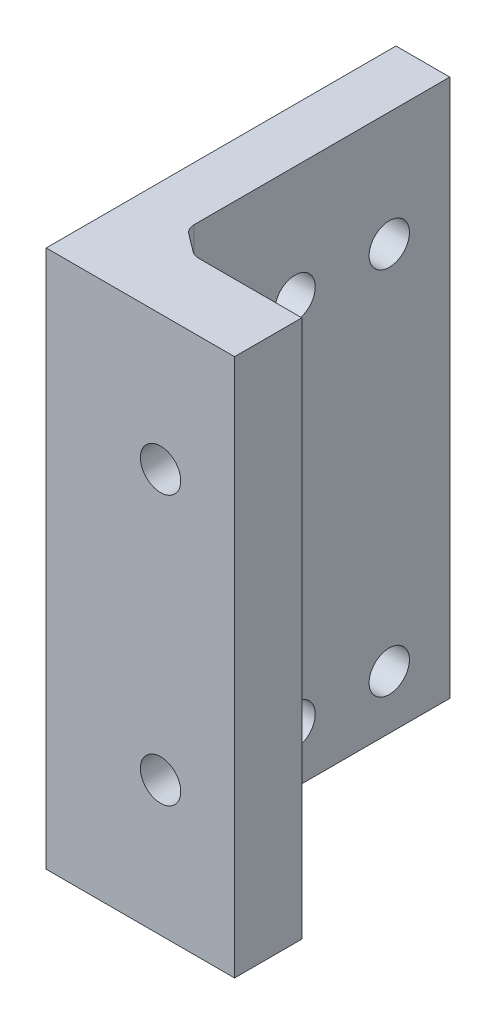
ISO-10303-21;
HEADER;
FILE_DESCRIPTION(('STEP AP214'),'2;1');
FILE_NAME('part.step','',(''),(''),'','','');
FILE_SCHEMA(('AUTOMOTIVE_DESIGN { 1 0 10303 214 1 1 1 1 }'));
ENDSEC;
DATA;
#1=APPLICATION_CONTEXT('core data for automotive mechanical design processes');
#2=APPLICATION_PROTOCOL_DEFINITION('international standard','automotive_design',2000,#1);
#3=PRODUCT_CONTEXT('',#1,'mechanical');
#4=PRODUCT('Part','Part','',(#3));
#5=PRODUCT_RELATED_PRODUCT_CATEGORY('part','',(#4));
#6=PRODUCT_DEFINITION_FORMATION('','',#4);
#7=PRODUCT_DEFINITION_CONTEXT('part definition',#1,'design');
#8=PRODUCT_DEFINITION('design','',#6,#7);
#9=PRODUCT_DEFINITION_SHAPE('','',#8);
#10=(LENGTH_UNIT() NAMED_UNIT(*) SI_UNIT(.MILLI.,.METRE.));
#11=(NAMED_UNIT(*) PLANE_ANGLE_UNIT() SI_UNIT($,.RADIAN.));
#12=(NAMED_UNIT(*) SI_UNIT($,.STERADIAN.) SOLID_ANGLE_UNIT());
#13=UNCERTAINTY_MEASURE_WITH_UNIT(LENGTH_MEASURE(1.E-05),#10,'distance_accuracy_value','');
#14=(GEOMETRIC_REPRESENTATION_CONTEXT(3) GLOBAL_UNCERTAINTY_ASSIGNED_CONTEXT((#13)) GLOBAL_UNIT_ASSIGNED_CONTEXT((#10,
#11,#12)) REPRESENTATION_CONTEXT('',''));
#15=CARTESIAN_POINT('',(0.,0.,0.));
#16=DIRECTION('',(0.,0.,1.));
#17=DIRECTION('',(1.,0.,0.));
#18=AXIS2_PLACEMENT_3D('',#15,#16,#17);
#19=CARTESIAN_POINT('',(15.,-20.,-4.));
#20=DIRECTION('',(1.,0.,0.));
#21=DIRECTION('',(0.,0.,-1.));
#22=AXIS2_PLACEMENT_3D('',#19,#20,#21);
#23=PLANE('',#22);
#24=DIRECTION('',(0.,0.,1.));
#25=VECTOR('',#24,1.);
#26=CARTESIAN_POINT('',(15.,20.,-4.));
#27=LINE('',#26,#25);
#28=CARTESIAN_POINT('',(15.,20.,-4.));
#29=VERTEX_POINT('',#28);
#30=CARTESIAN_POINT('',(15.,20.,15.));
#31=VERTEX_POINT('',#30);
#32=EDGE_CURVE('E189',#29,#31,#27,.T.);
#33=ORIENTED_EDGE('',*,*,#32,.T.);
#34=DIRECTION('',(0.,-1.,0.));
#35=VECTOR('',#34,1.);
#36=CARTESIAN_POINT('',(15.,-20.,15.));
#37=LINE('',#36,#35);
#38=CARTESIAN_POINT('',(15.,-20.,15.));
#39=VERTEX_POINT('',#38);
#40=EDGE_CURVE('E190',#31,#39,#37,.T.);
#41=ORIENTED_EDGE('',*,*,#40,.T.);
#42=DIRECTION('',(0.,0.,1.));
#43=VECTOR('',#42,1.);
#44=CARTESIAN_POINT('',(15.,-20.,-4.));
#45=LINE('',#44,#43);
#46=CARTESIAN_POINT('',(15.,-20.,-4.));
#47=VERTEX_POINT('',#46);
#48=EDGE_CURVE('E114',#47,#39,#45,.T.);
#49=ORIENTED_EDGE('',*,*,#48,.F.);
#50=DIRECTION('',(0.,1.,0.));
#51=VECTOR('',#50,1.);
#52=CARTESIAN_POINT('',(15.,-20.,-4.));
#53=LINE('',#52,#51);
#54=EDGE_CURVE('E178',#47,#29,#53,.T.);
#55=ORIENTED_EDGE('',*,*,#54,.T.);
#56=EDGE_LOOP('',(#33,#41,#49,#55));
#57=FACE_BOUND('',#56,.T.);
#58=CARTESIAN_POINT('',(15.,11.499999999999,7.5));
#59=DIRECTION('',(1.,0.,0.));
#60=DIRECTION('',(0.,0.,-1.));
#61=AXIS2_PLACEMENT_3D('',#58,#59,#60);
#62=CIRCLE('',#61,1.5);
#63=CARTESIAN_POINT('',(15.,11.499999999999,6.));
#64=VERTEX_POINT('',#63);
#65=EDGE_CURVE('E156',#64,#64,#62,.T.);
#66=ORIENTED_EDGE('',*,*,#65,.F.);
#67=EDGE_LOOP('',(#66));
#68=FACE_BOUND('',#67,.T.);
#69=CARTESIAN_POINT('',(15.,-16.000000000001,7.5));
#70=DIRECTION('',(1.,0.,0.));
#71=DIRECTION('',(0.,0.,-1.));
#72=AXIS2_PLACEMENT_3D('',#69,#70,#71);
#73=CIRCLE('',#72,1.5);
#74=CARTESIAN_POINT('',(15.,-16.000000000001,6.));
#75=VERTEX_POINT('',#74);
#76=EDGE_CURVE('E167',#75,#75,#73,.T.);
#77=ORIENTED_EDGE('',*,*,#76,.F.);
#78=EDGE_LOOP('',(#77));
#79=FACE_BOUND('',#78,.T.);
#80=CARTESIAN_POINT('',(15.,-16.000000000001,0.499999999999231));
#81=DIRECTION('',(1.,0.,0.));
#82=DIRECTION('',(0.,0.,-1.));
#83=AXIS2_PLACEMENT_3D('',#80,#81,#82);
#84=CIRCLE('',#83,1.5);
#85=CARTESIAN_POINT('',(15.,-16.000000000001,-1.00000000000077));
#86=VERTEX_POINT('',#85);
#87=EDGE_CURVE('E161',#86,#86,#84,.T.);
#88=ORIENTED_EDGE('',*,*,#87,.F.);
#89=EDGE_LOOP('',(#88));
#90=FACE_BOUND('',#89,.T.);
#91=CARTESIAN_POINT('',(15.,11.499999999999,0.499999999999007));
#92=DIRECTION('',(1.,0.,0.));
#93=DIRECTION('',(0.,0.,-1.));
#94=AXIS2_PLACEMENT_3D('',#91,#92,#93);
#95=CIRCLE('',#94,1.5);
#96=CARTESIAN_POINT('',(15.,11.499999999999,-1.00000000000099));
#97=VERTEX_POINT('',#96);
#98=EDGE_CURVE('E160',#97,#97,#95,.T.);
#99=ORIENTED_EDGE('',*,*,#98,.F.);
#100=EDGE_LOOP('',(#99));
#101=FACE_BOUND('',#100,.T.);
#102=ADVANCED_FACE('F34',(#57,#68,#79,#90,#101),#23,.T.);
#103=CARTESIAN_POINT('',(15.,-20.,-4.));
#104=DIRECTION('',(0.,-1.,0.));
#105=DIRECTION('',(1.,0.,0.));
#106=AXIS2_PLACEMENT_3D('',#103,#104,#105);
#107=PLANE('',#106);
#108=ORIENTED_EDGE('',*,*,#48,.T.);
#109=CARTESIAN_POINT('',(16.,-20.,15.));
#110=DIRECTION('',(0.,-1.,0.));
#111=DIRECTION('',(1.,0.,0.));
#112=AXIS2_PLACEMENT_3D('',#109,#110,#111);
#113=CIRCLE('',#112,1.);
#114=CARTESIAN_POINT('',(15.4,-20.,15.8));
#115=VERTEX_POINT('',#114);
#116=EDGE_CURVE('E203',#39,#115,#113,.F.);
#117=ORIENTED_EDGE('',*,*,#116,.T.);
#118=DIRECTION('',(0.799999999999999,0.,0.600000000000001));
#119=VECTOR('',#118,1.);
#120=CARTESIAN_POINT('',(15.,-20.,15.5));
#121=LINE('',#120,#119);
#122=CARTESIAN_POINT('',(16.7333333333334,-20.,16.8));
#123=VERTEX_POINT('',#122);
#124=EDGE_CURVE('E221',#115,#123,#121,.T.);
#125=ORIENTED_EDGE('',*,*,#124,.T.);
#126=CARTESIAN_POINT('',(17.3333333333334,-20.,16.));
#127=DIRECTION('',(0.,-1.,0.));
#128=DIRECTION('',(1.,0.,0.));
#129=AXIS2_PLACEMENT_3D('',#126,#127,#128);
#130=CIRCLE('',#129,1.);
#131=CARTESIAN_POINT('',(17.3333333333334,-20.,17.));
#132=VERTEX_POINT('',#131);
#133=EDGE_CURVE('E42',#123,#132,#130,.F.);
#134=ORIENTED_EDGE('',*,*,#133,.T.);
#135=DIRECTION('',(-1.,0.,0.));
#136=VECTOR('',#135,1.);
#137=CARTESIAN_POINT('',(25.,-20.,17.));
#138=LINE('',#137,#136);
#139=CARTESIAN_POINT('',(25.,-20.,17.));
#140=VERTEX_POINT('',#139);
#141=EDGE_CURVE('E154',#140,#132,#138,.T.);
#142=ORIENTED_EDGE('',*,*,#141,.F.);
#143=DIRECTION('',(0.,0.,-1.));
#144=VECTOR('',#143,1.);
#145=CARTESIAN_POINT('',(25.,-20.,20.));
#146=LINE('',#145,#144);
#147=CARTESIAN_POINT('',(25.,-20.,22.));
#148=VERTEX_POINT('',#147);
#149=EDGE_CURVE('E121',#148,#140,#146,.T.);
#150=ORIENTED_EDGE('',*,*,#149,.F.);
#151=DIRECTION('',(1.,0.,0.));
#152=VECTOR('',#151,1.);
#153=CARTESIAN_POINT('',(11.,-20.,22.));
#154=LINE('',#153,#152);
#155=CARTESIAN_POINT('',(11.,-20.,22.));
#156=VERTEX_POINT('',#155);
#157=EDGE_CURVE('E118',#156,#148,#154,.T.);
#158=ORIENTED_EDGE('',*,*,#157,.F.);
#159=DIRECTION('',(0.,0.,1.));
#160=VECTOR('',#159,1.);
#161=CARTESIAN_POINT('',(11.,-20.,-4.));
#162=LINE('',#161,#160);
#163=CARTESIAN_POINT('',(11.,-20.,-4.));
#164=VERTEX_POINT('',#163);
#165=EDGE_CURVE('E105',#164,#156,#162,.T.);
#166=ORIENTED_EDGE('',*,*,#165,.F.);
#167=DIRECTION('',(1.,0.,0.));
#168=VECTOR('',#167,1.);
#169=CARTESIAN_POINT('',(15.,-20.,-4.));
#170=LINE('',#169,#168);
#171=EDGE_CURVE('E187',#164,#47,#170,.T.);
#172=ORIENTED_EDGE('',*,*,#171,.T.);
#173=EDGE_LOOP('',(#108,#117,#125,#134,#142,#150,#158,#166,#172));
#174=FACE_BOUND('',#173,.T.);
#175=ADVANCED_FACE('F120',(#174),#107,.T.);
#176=CARTESIAN_POINT('',(11.,-20.,-4.));
#177=DIRECTION('',(-1.,0.,0.));
#178=DIRECTION('',(0.,-1.,0.));
#179=AXIS2_PLACEMENT_3D('',#176,#177,#178);
#180=PLANE('',#179);
#181=CARTESIAN_POINT('',(11.,11.499999999999,7.5));
#182=DIRECTION('',(1.,0.,0.));
#183=DIRECTION('',(0.,0.,-1.));
#184=AXIS2_PLACEMENT_3D('',#181,#182,#183);
#185=CIRCLE('',#184,1.5);
#186=CARTESIAN_POINT('',(11.,11.499999999999,6.));
#187=VERTEX_POINT('',#186);
#188=EDGE_CURVE('E170',#187,#187,#185,.T.);
#189=ORIENTED_EDGE('',*,*,#188,.T.);
#190=EDGE_LOOP('',(#189));
#191=FACE_BOUND('',#190,.T.);
#192=CARTESIAN_POINT('',(11.,-16.000000000001,7.5));
#193=DIRECTION('',(1.,0.,0.));
#194=DIRECTION('',(0.,0.,-1.));
#195=AXIS2_PLACEMENT_3D('',#192,#193,#194);
#196=CIRCLE('',#195,1.5);
#197=CARTESIAN_POINT('',(11.,-16.000000000001,6.));
#198=VERTEX_POINT('',#197);
#199=EDGE_CURVE('E164',#198,#198,#196,.T.);
#200=ORIENTED_EDGE('',*,*,#199,.T.);
#201=EDGE_LOOP('',(#200));
#202=FACE_BOUND('',#201,.T.);
#203=CARTESIAN_POINT('',(11.,-16.000000000001,0.499999999999231));
#204=DIRECTION('',(1.,0.,0.));
#205=DIRECTION('',(0.,0.,-1.));
#206=AXIS2_PLACEMENT_3D('',#203,#204,#205);
#207=CIRCLE('',#206,1.5);
#208=CARTESIAN_POINT('',(11.,-16.000000000001,-1.00000000000077));
#209=VERTEX_POINT('',#208);
#210=EDGE_CURVE('E157',#209,#209,#207,.T.);
#211=ORIENTED_EDGE('',*,*,#210,.T.);
#212=EDGE_LOOP('',(#211));
#213=FACE_BOUND('',#212,.T.);
#214=CARTESIAN_POINT('',(11.,11.499999999999,0.499999999999007));
#215=DIRECTION('',(1.,0.,0.));
#216=DIRECTION('',(0.,0.,-1.));
#217=AXIS2_PLACEMENT_3D('',#214,#215,#216);
#218=CIRCLE('',#217,1.5);
#219=CARTESIAN_POINT('',(11.,11.499999999999,-1.00000000000099));
#220=VERTEX_POINT('',#219);
#221=EDGE_CURVE('E175',#220,#220,#218,.T.);
#222=ORIENTED_EDGE('',*,*,#221,.T.);
#223=EDGE_LOOP('',(#222));
#224=FACE_BOUND('',#223,.T.);
#225=ORIENTED_EDGE('',*,*,#165,.T.);
#226=DIRECTION('',(0.,-1.,0.));
#227=VECTOR('',#226,1.);
#228=CARTESIAN_POINT('',(11.,20.,22.));
#229=LINE('',#228,#227);
#230=CARTESIAN_POINT('',(11.,20.,22.));
#231=VERTEX_POINT('',#230);
#232=EDGE_CURVE('E109',#231,#156,#229,.T.);
#233=ORIENTED_EDGE('',*,*,#232,.F.);
#234=DIRECTION('',(0.,0.,1.));
#235=VECTOR('',#234,1.);
#236=CARTESIAN_POINT('',(11.,20.,-4.));
#237=LINE('',#236,#235);
#238=CARTESIAN_POINT('',(11.,20.,-4.));
#239=VERTEX_POINT('',#238);
#240=EDGE_CURVE('E115',#239,#231,#237,.T.);
#241=ORIENTED_EDGE('',*,*,#240,.F.);
#242=DIRECTION('',(0.,-1.,0.));
#243=VECTOR('',#242,1.);
#244=CARTESIAN_POINT('',(11.,-20.,-4.));
#245=LINE('',#244,#243);
#246=EDGE_CURVE('E111',#239,#164,#245,.T.);
#247=ORIENTED_EDGE('',*,*,#246,.T.);
#248=EDGE_LOOP('',(#225,#233,#241,#247));
#249=FACE_BOUND('',#248,.T.);
#250=ADVANCED_FACE('F107',(#191,#202,#213,#224,#249),#180,.T.);
#251=CARTESIAN_POINT('',(15.,20.,-4.));
#252=DIRECTION('',(0.,1.,0.));
#253=DIRECTION('',(0.,0.,1.));
#254=AXIS2_PLACEMENT_3D('',#251,#252,#253);
#255=PLANE('',#254);
#256=DIRECTION('',(0.799999999999999,0.,0.600000000000001));
#257=VECTOR('',#256,1.);
#258=CARTESIAN_POINT('',(15.,20.,15.5));
#259=LINE('',#258,#257);
#260=CARTESIAN_POINT('',(15.4,20.,15.8));
#261=VERTEX_POINT('',#260);
#262=CARTESIAN_POINT('',(16.7333333333333,20.,16.8));
#263=VERTEX_POINT('',#262);
#264=EDGE_CURVE('E212',#261,#263,#259,.T.);
#265=ORIENTED_EDGE('',*,*,#264,.F.);
#266=CARTESIAN_POINT('',(16.,20.,15.));
#267=DIRECTION('',(0.,1.,0.));
#268=DIRECTION('',(0.,0.,1.));
#269=AXIS2_PLACEMENT_3D('',#266,#267,#268);
#270=CIRCLE('',#269,1.);
#271=EDGE_CURVE('E205',#261,#31,#270,.F.);
#272=ORIENTED_EDGE('',*,*,#271,.T.);
#273=ORIENTED_EDGE('',*,*,#32,.F.);
#274=DIRECTION('',(-1.,0.,0.));
#275=VECTOR('',#274,1.);
#276=CARTESIAN_POINT('',(15.,20.,-4.));
#277=LINE('',#276,#275);
#278=EDGE_CURVE('E183',#29,#239,#277,.T.);
#279=ORIENTED_EDGE('',*,*,#278,.T.);
#280=ORIENTED_EDGE('',*,*,#240,.T.);
#281=DIRECTION('',(-1.,0.,0.));
#282=VECTOR('',#281,1.);
#283=CARTESIAN_POINT('',(11.,20.,22.));
#284=LINE('',#283,#282);
#285=CARTESIAN_POINT('',(25.,20.,22.));
#286=VERTEX_POINT('',#285);
#287=EDGE_CURVE('E131',#286,#231,#284,.T.);
#288=ORIENTED_EDGE('',*,*,#287,.F.);
#289=DIRECTION('',(0.,0.,1.));
#290=VECTOR('',#289,1.);
#291=CARTESIAN_POINT('',(25.,20.,20.));
#292=LINE('',#291,#290);
#293=CARTESIAN_POINT('',(25.,20.,17.));
#294=VERTEX_POINT('',#293);
#295=EDGE_CURVE('E150',#294,#286,#292,.T.);
#296=ORIENTED_EDGE('',*,*,#295,.F.);
#297=DIRECTION('',(-1.,0.,0.));
#298=VECTOR('',#297,1.);
#299=CARTESIAN_POINT('',(25.,20.,17.));
#300=LINE('',#299,#298);
#301=CARTESIAN_POINT('',(17.3333333333333,20.,17.));
#302=VERTEX_POINT('',#301);
#303=EDGE_CURVE('E152',#294,#302,#300,.T.);
#304=ORIENTED_EDGE('',*,*,#303,.T.);
#305=CARTESIAN_POINT('',(17.3333333333333,20.,16.));
#306=DIRECTION('',(0.,1.,0.));
#307=DIRECTION('',(0.,0.,1.));
#308=AXIS2_PLACEMENT_3D('',#305,#306,#307);
#309=CIRCLE('',#308,1.);
#310=EDGE_CURVE('E11',#302,#263,#309,.F.);
#311=ORIENTED_EDGE('',*,*,#310,.T.);
#312=EDGE_LOOP('',(#265,#272,#273,#279,#280,#288,#296,#304,#311));
#313=FACE_BOUND('',#312,.T.);
#314=ADVANCED_FACE('F209',(#313),#255,.T.);
#315=CARTESIAN_POINT('',(0.,0.,-4.));
#316=DIRECTION('',(0.,0.,1.));
#317=DIRECTION('',(1.,0.,0.));
#318=AXIS2_PLACEMENT_3D('',#315,#316,#317);
#319=PLANE('',#318);
#320=ORIENTED_EDGE('',*,*,#54,.F.);
#321=ORIENTED_EDGE('',*,*,#171,.F.);
#322=ORIENTED_EDGE('',*,*,#246,.F.);
#323=ORIENTED_EDGE('',*,*,#278,.F.);
#324=EDGE_LOOP('',(#320,#321,#322,#323));
#325=FACE_BOUND('',#324,.T.);
#326=ADVANCED_FACE('F265',(#325),#319,.F.);
#327=CARTESIAN_POINT('',(11.,11.499999999999,0.499999999999007));
#328=DIRECTION('',(1.,0.,0.));
#329=DIRECTION('',(0.,0.,-1.));
#330=AXIS2_PLACEMENT_3D('',#327,#328,#329);
#331=CYLINDRICAL_SURFACE('',#330,1.5);
#332=ORIENTED_EDGE('',*,*,#221,.F.);
#333=EDGE_LOOP('',(#332));
#334=FACE_BOUND('',#333,.T.);
#335=ORIENTED_EDGE('',*,*,#98,.T.);
#336=EDGE_LOOP('',(#335));
#337=FACE_BOUND('',#336,.T.);
#338=ADVANCED_FACE('F267',(#334,#337),#331,.F.);
#339=CARTESIAN_POINT('',(11.,-16.000000000001,0.499999999999231));
#340=DIRECTION('',(1.,0.,0.));
#341=DIRECTION('',(0.,0.,-1.));
#342=AXIS2_PLACEMENT_3D('',#339,#340,#341);
#343=CYLINDRICAL_SURFACE('',#342,1.5);
#344=ORIENTED_EDGE('',*,*,#210,.F.);
#345=EDGE_LOOP('',(#344));
#346=FACE_BOUND('',#345,.T.);
#347=ORIENTED_EDGE('',*,*,#87,.T.);
#348=EDGE_LOOP('',(#347));
#349=FACE_BOUND('',#348,.T.);
#350=ADVANCED_FACE('F273',(#346,#349),#343,.F.);
#351=CARTESIAN_POINT('',(11.,-16.000000000001,7.5));
#352=DIRECTION('',(1.,0.,0.));
#353=DIRECTION('',(0.,0.,-1.));
#354=AXIS2_PLACEMENT_3D('',#351,#352,#353);
#355=CYLINDRICAL_SURFACE('',#354,1.5);
#356=ORIENTED_EDGE('',*,*,#199,.F.);
#357=EDGE_LOOP('',(#356));
#358=FACE_BOUND('',#357,.T.);
#359=ORIENTED_EDGE('',*,*,#76,.T.);
#360=EDGE_LOOP('',(#359));
#361=FACE_BOUND('',#360,.T.);
#362=ADVANCED_FACE('F294',(#358,#361),#355,.F.);
#363=CARTESIAN_POINT('',(11.,11.499999999999,7.5));
#364=DIRECTION('',(1.,0.,0.));
#365=DIRECTION('',(0.,0.,-1.));
#366=AXIS2_PLACEMENT_3D('',#363,#364,#365);
#367=CYLINDRICAL_SURFACE('',#366,1.5);
#368=ORIENTED_EDGE('',*,*,#188,.F.);
#369=EDGE_LOOP('',(#368));
#370=FACE_BOUND('',#369,.T.);
#371=ORIENTED_EDGE('',*,*,#65,.T.);
#372=EDGE_LOOP('',(#371));
#373=FACE_BOUND('',#372,.T.);
#374=ADVANCED_FACE('F301',(#370,#373),#367,.F.);
#375=CARTESIAN_POINT('',(25.,20.,17.));
#376=DIRECTION('',(0.,0.,1.));
#377=DIRECTION('',(0.,-1.,0.));
#378=AXIS2_PLACEMENT_3D('',#375,#376,#377);
#379=PLANE('',#378);
#380=CARTESIAN_POINT('',(19.5,-9.99999999999999,17.));
#381=DIRECTION('',(0.,0.,-1.));
#382=DIRECTION('',(0.,1.,0.));
#383=AXIS2_PLACEMENT_3D('',#380,#381,#382);
#384=CIRCLE('',#383,1.5);
#385=CARTESIAN_POINT('',(19.5,-8.49999999999999,17.));
#386=VERTEX_POINT('',#385);
#387=EDGE_CURVE('E142',#386,#386,#384,.T.);
#388=ORIENTED_EDGE('',*,*,#387,.F.);
#389=EDGE_LOOP('',(#388));
#390=FACE_BOUND('',#389,.T.);
#391=CARTESIAN_POINT('',(19.5,10.,17.));
#392=DIRECTION('',(0.,0.,-1.));
#393=DIRECTION('',(0.,1.,0.));
#394=AXIS2_PLACEMENT_3D('',#391,#392,#393);
#395=CIRCLE('',#394,1.5);
#396=CARTESIAN_POINT('',(19.5,11.5,17.));
#397=VERTEX_POINT('',#396);
#398=EDGE_CURVE('E141',#397,#397,#395,.T.);
#399=ORIENTED_EDGE('',*,*,#398,.F.);
#400=EDGE_LOOP('',(#399));
#401=FACE_BOUND('',#400,.T.);
#402=ORIENTED_EDGE('',*,*,#141,.T.);
#403=DIRECTION('',(0.,-1.,0.));
#404=VECTOR('',#403,1.);
#405=CARTESIAN_POINT('',(17.3333333333333,20.,17.));
#406=LINE('',#405,#404);
#407=EDGE_CURVE('E49',#132,#302,#406,.F.);
#408=ORIENTED_EDGE('',*,*,#407,.T.);
#409=ORIENTED_EDGE('',*,*,#303,.F.);
#410=DIRECTION('',(0.,1.,0.));
#411=VECTOR('',#410,1.);
#412=CARTESIAN_POINT('',(25.,20.,17.));
#413=LINE('',#412,#411);
#414=EDGE_CURVE('E148',#140,#294,#413,.T.);
#415=ORIENTED_EDGE('',*,*,#414,.F.);
#416=EDGE_LOOP('',(#402,#408,#409,#415));
#417=FACE_BOUND('',#416,.T.);
#418=ADVANCED_FACE('F261',(#390,#401,#417),#379,.F.);
#419=CARTESIAN_POINT('',(25.,0.,0.));
#420=DIRECTION('',(1.,0.,0.));
#421=DIRECTION('',(0.,0.,-1.));
#422=AXIS2_PLACEMENT_3D('',#419,#420,#421);
#423=PLANE('',#422);
#424=ORIENTED_EDGE('',*,*,#295,.T.);
#425=DIRECTION('',(0.,1.,0.));
#426=VECTOR('',#425,1.);
#427=CARTESIAN_POINT('',(25.,20.,22.));
#428=LINE('',#427,#426);
#429=EDGE_CURVE('E125',#148,#286,#428,.T.);
#430=ORIENTED_EDGE('',*,*,#429,.F.);
#431=ORIENTED_EDGE('',*,*,#149,.T.);
#432=ORIENTED_EDGE('',*,*,#414,.T.);
#433=EDGE_LOOP('',(#424,#430,#431,#432));
#434=FACE_BOUND('',#433,.T.);
#435=ADVANCED_FACE('F263',(#434),#423,.T.);
#436=CARTESIAN_POINT('',(19.5,10.,20.));
#437=DIRECTION('',(0.,0.,-1.));
#438=DIRECTION('',(0.,1.,0.));
#439=AXIS2_PLACEMENT_3D('',#436,#437,#438);
#440=CYLINDRICAL_SURFACE('',#439,1.5);
#441=CARTESIAN_POINT('',(19.5,10.,22.));
#442=DIRECTION('',(0.,0.,1.));
#443=DIRECTION('',(1.,0.,0.));
#444=AXIS2_PLACEMENT_3D('',#441,#442,#443);
#445=CIRCLE('',#444,1.5);
#446=CARTESIAN_POINT('',(19.5,11.5,22.));
#447=VERTEX_POINT('',#446);
#448=EDGE_CURVE('E132',#447,#447,#445,.T.);
#449=CARTESIAN_POINT('',(19.5,11.5,17.));
#450=CARTESIAN_POINT('',(19.5,11.5,17.0520833333333));
#451=CARTESIAN_POINT('',(19.5,11.5,17.1041666666667));
#452=CARTESIAN_POINT('',(19.5,11.5,17.2083333333333));
#453=CARTESIAN_POINT('',(19.5,11.5,17.2604166666667));
#454=CARTESIAN_POINT('',(19.5,11.5,17.3645833333333));
#455=CARTESIAN_POINT('',(19.5,11.5,17.4166666666667));
#456=CARTESIAN_POINT('',(19.5,11.5,17.5208333333333));
#457=CARTESIAN_POINT('',(19.5,11.5,17.5729166666667));
#458=CARTESIAN_POINT('',(19.5,11.5,17.6770833333333));
#459=CARTESIAN_POINT('',(19.5,11.5,17.7291666666667));
#460=CARTESIAN_POINT('',(19.5,11.5,17.8333333333333));
#461=CARTESIAN_POINT('',(19.5,11.5,17.8854166666667));
#462=CARTESIAN_POINT('',(19.5,11.5,17.9895833333333));
#463=CARTESIAN_POINT('',(19.5,11.5,18.0416666666667));
#464=CARTESIAN_POINT('',(19.5,11.5,18.1458333333333));
#465=CARTESIAN_POINT('',(19.5,11.5,18.1979166666667));
#466=CARTESIAN_POINT('',(19.5,11.5,18.3020833333333));
#467=CARTESIAN_POINT('',(19.5,11.5,18.3541666666667));
#468=CARTESIAN_POINT('',(19.5,11.5,18.4583333333333));
#469=CARTESIAN_POINT('',(19.5,11.5,18.5104166666667));
#470=CARTESIAN_POINT('',(19.5,11.5,18.6145833333333));
#471=CARTESIAN_POINT('',(19.5,11.5,18.6666666666667));
#472=CARTESIAN_POINT('',(19.5,11.5,18.7708333333333));
#473=CARTESIAN_POINT('',(19.5,11.5,18.8229166666667));
#474=CARTESIAN_POINT('',(19.5,11.5,18.9270833333333));
#475=CARTESIAN_POINT('',(19.5,11.5,18.9791666666667));
#476=CARTESIAN_POINT('',(19.5,11.5,19.0833333333333));
#477=CARTESIAN_POINT('',(19.5,11.5,19.1354166666667));
#478=CARTESIAN_POINT('',(19.5,11.5,19.2395833333333));
#479=CARTESIAN_POINT('',(19.5,11.5,19.2916666666667));
#480=CARTESIAN_POINT('',(19.5,11.5,19.3958333333333));
#481=CARTESIAN_POINT('',(19.5,11.5,19.4479166666667));
#482=CARTESIAN_POINT('',(19.5,11.5,19.5520833333333));
#483=CARTESIAN_POINT('',(19.5,11.5,19.6041666666667));
#484=CARTESIAN_POINT('',(19.5,11.5,19.7083333333333));
#485=CARTESIAN_POINT('',(19.5,11.5,19.7604166666667));
#486=CARTESIAN_POINT('',(19.5,11.5,19.8645833333333));
#487=CARTESIAN_POINT('',(19.5,11.5,19.9166666666667));
#488=CARTESIAN_POINT('',(19.5,11.5,20.0208333333333));
#489=CARTESIAN_POINT('',(19.5,11.5,20.0729166666667));
#490=CARTESIAN_POINT('',(19.5,11.5,20.1770833333333));
#491=CARTESIAN_POINT('',(19.5,11.5,20.2291666666667));
#492=CARTESIAN_POINT('',(19.5,11.5,20.3333333333333));
#493=CARTESIAN_POINT('',(19.5,11.5,20.3854166666667));
#494=CARTESIAN_POINT('',(19.5,11.5,20.4895833333333));
#495=CARTESIAN_POINT('',(19.5,11.5,20.5416666666667));
#496=CARTESIAN_POINT('',(19.5,11.5,20.6458333333333));
#497=CARTESIAN_POINT('',(19.5,11.5,20.6979166666667));
#498=CARTESIAN_POINT('',(19.5,11.5,20.8020833333333));
#499=CARTESIAN_POINT('',(19.5,11.5,20.8541666666667));
#500=CARTESIAN_POINT('',(19.5,11.5,20.9583333333333));
#501=CARTESIAN_POINT('',(19.5,11.5,21.0104166666667));
#502=CARTESIAN_POINT('',(19.5,11.5,21.1145833333333));
#503=CARTESIAN_POINT('',(19.5,11.5,21.1666666666667));
#504=CARTESIAN_POINT('',(19.5,11.5,21.2708333333333));
#505=CARTESIAN_POINT('',(19.5,11.5,21.3229166666667));
#506=CARTESIAN_POINT('',(19.5,11.5,21.4270833333333));
#507=CARTESIAN_POINT('',(19.5,11.5,21.4791666666667));
#508=CARTESIAN_POINT('',(19.5,11.5,21.5833333333333));
#509=CARTESIAN_POINT('',(19.5,11.5,21.6354166666667));
#510=CARTESIAN_POINT('',(19.5,11.5,21.7395833333333));
#511=CARTESIAN_POINT('',(19.5,11.5,21.7916666666667));
#512=CARTESIAN_POINT('',(19.5,11.5,21.8958333333333));
#513=CARTESIAN_POINT('',(19.5,11.5,21.9479166666667));
#514=CARTESIAN_POINT('',(19.5,11.5,22.));
#515=B_SPLINE_CURVE_WITH_KNOTS('',3,(#449,#450,#451,#452,#453,#454,#455,#456,#457,#458,#459,
#460,#461,#462,#463,#464,#465,#466,#467,#468,#469,#470,#471,#472,#473,#474,#475,#476,#477,#478,
#479,#480,#481,#482,#483,#484,#485,#486,#487,#488,#489,#490,#491,#492,#493,#494,#495,#496,#497,
#498,#499,#500,#501,#502,#503,#504,#505,#506,#507,#508,#509,#510,#511,#512,#513,#514),
.UNSPECIFIED.,.F.,.F.,(4,2,2,2,2,2,2,2,2,2,2,2,2,2,2,2,2,2,2,2,2,2,2,2,2,2,2,2,2,2,2,2,4),(0.,
0.15625,0.3125,0.46875,0.625000000000001,0.781250000000001,0.937500000000001,1.09375,1.25,
1.40625,1.5625,1.71875,1.875,2.03125,2.1875,2.34375,2.5,2.65625,2.8125,2.96875,3.125,3.28125,
3.4375,3.59375,3.75,3.90625,4.0625,4.21875,4.375,4.53125,4.6875,4.84375,5.),.UNSPECIFIED.);
#516=EDGE_CURVE('BSEAM239',#397,#447,#515,.T.);
#517=ORIENTED_EDGE('',*,*,#398,.T.);
#518=ORIENTED_EDGE('',*,*,#448,.T.);
#519=ORIENTED_EDGE('',*,*,#516,.T.);
#520=ORIENTED_EDGE('',*,*,#516,.F.);
#521=EDGE_LOOP('',(#517,#519,#518,#520));
#522=FACE_BOUND('',#521,.T.);
#523=ADVANCED_FACE('F239',(#522),#440,.F.);
#524=CARTESIAN_POINT('',(19.5,-9.99999999999999,20.));
#525=DIRECTION('',(0.,0.,-1.));
#526=DIRECTION('',(0.,1.,0.));
#527=AXIS2_PLACEMENT_3D('',#524,#525,#526);
#528=CYLINDRICAL_SURFACE('',#527,1.5);
#529=CARTESIAN_POINT('',(19.5,-9.99999999999999,22.));
#530=DIRECTION('',(0.,0.,1.));
#531=DIRECTION('',(1.,0.,0.));
#532=AXIS2_PLACEMENT_3D('',#529,#530,#531);
#533=CIRCLE('',#532,1.5);
#534=CARTESIAN_POINT('',(19.5,-8.49999999999999,22.));
#535=VERTEX_POINT('',#534);
#536=EDGE_CURVE('E135',#535,#535,#533,.T.);
#537=CARTESIAN_POINT('',(19.5,-8.49999999999999,17.));
#538=CARTESIAN_POINT('',(19.5,-8.49999999999999,17.0520833333333));
#539=CARTESIAN_POINT('',(19.5,-8.49999999999999,17.1041666666667));
#540=CARTESIAN_POINT('',(19.5,-8.49999999999999,17.2083333333333));
#541=CARTESIAN_POINT('',(19.5,-8.49999999999999,17.2604166666667));
#542=CARTESIAN_POINT('',(19.5,-8.49999999999999,17.3645833333333));
#543=CARTESIAN_POINT('',(19.5,-8.49999999999999,17.4166666666667));
#544=CARTESIAN_POINT('',(19.5,-8.49999999999999,17.5208333333333));
#545=CARTESIAN_POINT('',(19.5,-8.49999999999999,17.5729166666667));
#546=CARTESIAN_POINT('',(19.5,-8.49999999999999,17.6770833333333));
#547=CARTESIAN_POINT('',(19.5,-8.49999999999999,17.7291666666667));
#548=CARTESIAN_POINT('',(19.5,-8.49999999999999,17.8333333333333));
#549=CARTESIAN_POINT('',(19.5,-8.49999999999999,17.8854166666667));
#550=CARTESIAN_POINT('',(19.5,-8.49999999999999,17.9895833333333));
#551=CARTESIAN_POINT('',(19.5,-8.49999999999999,18.0416666666667));
#552=CARTESIAN_POINT('',(19.5,-8.49999999999999,18.1458333333333));
#553=CARTESIAN_POINT('',(19.5,-8.49999999999999,18.1979166666667));
#554=CARTESIAN_POINT('',(19.5,-8.49999999999999,18.3020833333333));
#555=CARTESIAN_POINT('',(19.5,-8.49999999999999,18.3541666666667));
#556=CARTESIAN_POINT('',(19.5,-8.49999999999999,18.4583333333333));
#557=CARTESIAN_POINT('',(19.5,-8.49999999999999,18.5104166666667));
#558=CARTESIAN_POINT('',(19.5,-8.49999999999999,18.6145833333333));
#559=CARTESIAN_POINT('',(19.5,-8.49999999999999,18.6666666666667));
#560=CARTESIAN_POINT('',(19.5,-8.49999999999999,18.7708333333333));
#561=CARTESIAN_POINT('',(19.5,-8.49999999999999,18.8229166666667));
#562=CARTESIAN_POINT('',(19.5,-8.49999999999999,18.9270833333333));
#563=CARTESIAN_POINT('',(19.5,-8.49999999999999,18.9791666666667));
#564=CARTESIAN_POINT('',(19.5,-8.49999999999999,19.0833333333333));
#565=CARTESIAN_POINT('',(19.5,-8.49999999999999,19.1354166666667));
#566=CARTESIAN_POINT('',(19.5,-8.49999999999999,19.2395833333333));
#567=CARTESIAN_POINT('',(19.5,-8.49999999999999,19.2916666666667));
#568=CARTESIAN_POINT('',(19.5,-8.49999999999999,19.3958333333333));
#569=CARTESIAN_POINT('',(19.5,-8.49999999999999,19.4479166666667));
#570=CARTESIAN_POINT('',(19.5,-8.49999999999999,19.5520833333333));
#571=CARTESIAN_POINT('',(19.5,-8.49999999999999,19.6041666666667));
#572=CARTESIAN_POINT('',(19.5,-8.49999999999999,19.7083333333333));
#573=CARTESIAN_POINT('',(19.5,-8.49999999999999,19.7604166666667));
#574=CARTESIAN_POINT('',(19.5,-8.49999999999999,19.8645833333333));
#575=CARTESIAN_POINT('',(19.5,-8.49999999999999,19.9166666666667));
#576=CARTESIAN_POINT('',(19.5,-8.49999999999999,20.0208333333333));
#577=CARTESIAN_POINT('',(19.5,-8.49999999999999,20.0729166666667));
#578=CARTESIAN_POINT('',(19.5,-8.49999999999999,20.1770833333333));
#579=CARTESIAN_POINT('',(19.5,-8.49999999999999,20.2291666666667));
#580=CARTESIAN_POINT('',(19.5,-8.49999999999999,20.3333333333333));
#581=CARTESIAN_POINT('',(19.5,-8.49999999999999,20.3854166666667));
#582=CARTESIAN_POINT('',(19.5,-8.49999999999999,20.4895833333333));
#583=CARTESIAN_POINT('',(19.5,-8.49999999999999,20.5416666666667));
#584=CARTESIAN_POINT('',(19.5,-8.49999999999999,20.6458333333333));
#585=CARTESIAN_POINT('',(19.5,-8.49999999999999,20.6979166666667));
#586=CARTESIAN_POINT('',(19.5,-8.49999999999999,20.8020833333333));
#587=CARTESIAN_POINT('',(19.5,-8.49999999999999,20.8541666666667));
#588=CARTESIAN_POINT('',(19.5,-8.49999999999999,20.9583333333333));
#589=CARTESIAN_POINT('',(19.5,-8.49999999999999,21.0104166666667));
#590=CARTESIAN_POINT('',(19.5,-8.49999999999999,21.1145833333333));
#591=CARTESIAN_POINT('',(19.5,-8.49999999999999,21.1666666666667));
#592=CARTESIAN_POINT('',(19.5,-8.49999999999999,21.2708333333333));
#593=CARTESIAN_POINT('',(19.5,-8.49999999999999,21.3229166666667));
#594=CARTESIAN_POINT('',(19.5,-8.49999999999999,21.4270833333333));
#595=CARTESIAN_POINT('',(19.5,-8.49999999999999,21.4791666666667));
#596=CARTESIAN_POINT('',(19.5,-8.49999999999999,21.5833333333333));
#597=CARTESIAN_POINT('',(19.5,-8.49999999999999,21.6354166666667));
#598=CARTESIAN_POINT('',(19.5,-8.49999999999999,21.7395833333333));
#599=CARTESIAN_POINT('',(19.5,-8.49999999999999,21.7916666666667));
#600=CARTESIAN_POINT('',(19.5,-8.49999999999999,21.8958333333333));
#601=CARTESIAN_POINT('',(19.5,-8.49999999999999,21.9479166666667));
#602=CARTESIAN_POINT('',(19.5,-8.49999999999999,22.));
#603=B_SPLINE_CURVE_WITH_KNOTS('',3,(#537,#538,#539,#540,#541,#542,#543,#544,#545,#546,#547,
#548,#549,#550,#551,#552,#553,#554,#555,#556,#557,#558,#559,#560,#561,#562,#563,#564,#565,#566,
#567,#568,#569,#570,#571,#572,#573,#574,#575,#576,#577,#578,#579,#580,#581,#582,#583,#584,#585,
#586,#587,#588,#589,#590,#591,#592,#593,#594,#595,#596,#597,#598,#599,#600,#601,#602),
.UNSPECIFIED.,.F.,.F.,(4,2,2,2,2,2,2,2,2,2,2,2,2,2,2,2,2,2,2,2,2,2,2,2,2,2,2,2,2,2,2,2,4),(0.,
0.15625,0.3125,0.46875,0.625000000000001,0.781250000000001,0.937500000000001,1.09375,1.25,
1.40625,1.5625,1.71875,1.875,2.03125,2.1875,2.34375,2.5,2.65625,2.8125,2.96875,3.125,3.28125,
3.4375,3.59375,3.75,3.90625,4.0625,4.21875,4.375,4.53125,4.6875,4.84375,5.),.UNSPECIFIED.);
#604=EDGE_CURVE('BSEAM230',#386,#535,#603,.T.);
#605=ORIENTED_EDGE('',*,*,#387,.T.);
#606=ORIENTED_EDGE('',*,*,#536,.T.);
#607=ORIENTED_EDGE('',*,*,#604,.T.);
#608=ORIENTED_EDGE('',*,*,#604,.F.);
#609=EDGE_LOOP('',(#605,#607,#606,#608));
#610=FACE_BOUND('',#609,.T.);
#611=ADVANCED_FACE('F230',(#610),#528,.F.);
#612=CARTESIAN_POINT('',(0.,0.,22.));
#613=DIRECTION('',(0.,0.,1.));
#614=DIRECTION('',(1.,0.,0.));
#615=AXIS2_PLACEMENT_3D('',#612,#613,#614);
#616=PLANE('',#615);
#617=ORIENTED_EDGE('',*,*,#448,.F.);
#618=EDGE_LOOP('',(#617));
#619=FACE_BOUND('',#618,.T.);
#620=ORIENTED_EDGE('',*,*,#232,.T.);
#621=ORIENTED_EDGE('',*,*,#157,.T.);
#622=ORIENTED_EDGE('',*,*,#429,.T.);
#623=ORIENTED_EDGE('',*,*,#287,.T.);
#624=EDGE_LOOP('',(#620,#621,#622,#623));
#625=FACE_BOUND('',#624,.T.);
#626=ORIENTED_EDGE('',*,*,#536,.F.);
#627=EDGE_LOOP('',(#626));
#628=FACE_BOUND('',#627,.T.);
#629=ADVANCED_FACE('F128',(#619,#625,#628),#616,.T.);
#630=CARTESIAN_POINT('',(15.,22.5,15.5));
#631=DIRECTION('',(0.600000000000001,0.,-0.799999999999999));
#632=DIRECTION('',(-0.799999999999999,0.,-0.600000000000001));
#633=AXIS2_PLACEMENT_3D('',#630,#631,#632);
#634=PLANE('',#633);
#635=ORIENTED_EDGE('',*,*,#124,.F.);
#636=DIRECTION('',(0.,-1.,0.));
#637=VECTOR('',#636,1.);
#638=CARTESIAN_POINT('',(15.4,20.,15.8));
#639=LINE('',#638,#637);
#640=EDGE_CURVE('E200',#115,#261,#639,.F.);
#641=ORIENTED_EDGE('',*,*,#640,.T.);
#642=ORIENTED_EDGE('',*,*,#264,.T.);
#643=DIRECTION('',(0.,-1.,0.));
#644=VECTOR('',#643,1.);
#645=CARTESIAN_POINT('',(16.7333333333333,22.5,16.8));
#646=LINE('',#645,#644);
#647=EDGE_CURVE('E197',#263,#123,#646,.T.);
#648=ORIENTED_EDGE('',*,*,#647,.T.);
#649=EDGE_LOOP('',(#635,#641,#642,#648));
#650=FACE_BOUND('',#649,.T.);
#651=ADVANCED_FACE('F223',(#650),#634,.T.);
#652=CARTESIAN_POINT('',(16.,-20.,15.));
#653=DIRECTION('',(0.,1.,0.));
#654=DIRECTION('',(0.,0.,1.));
#655=AXIS2_PLACEMENT_3D('',#652,#653,#654);
#656=CYLINDRICAL_SURFACE('',#655,1.);
#657=ORIENTED_EDGE('',*,*,#271,.F.);
#658=ORIENTED_EDGE('',*,*,#640,.F.);
#659=ORIENTED_EDGE('',*,*,#116,.F.);
#660=ORIENTED_EDGE('',*,*,#40,.F.);
#661=EDGE_LOOP('',(#657,#658,#659,#660));
#662=FACE_BOUND('',#661,.T.);
#663=ADVANCED_FACE('F219',(#662),#656,.F.);
#664=CARTESIAN_POINT('',(17.3333333333333,22.5,16.));
#665=DIRECTION('',(0.,-1.,0.));
#666=DIRECTION('',(1.,0.,0.));
#667=AXIS2_PLACEMENT_3D('',#664,#665,#666);
#668=CYLINDRICAL_SURFACE('',#667,1.);
#669=ORIENTED_EDGE('',*,*,#310,.F.);
#670=ORIENTED_EDGE('',*,*,#407,.F.);
#671=ORIENTED_EDGE('',*,*,#133,.F.);
#672=ORIENTED_EDGE('',*,*,#647,.F.);
#673=EDGE_LOOP('',(#669,#670,#671,#672));
#674=FACE_BOUND('',#673,.T.);
#675=ADVANCED_FACE('F36',(#674),#668,.F.);
#676=CLOSED_SHELL('',(#102,#175,#250,#314,#326,#338,#350,#362,#374,#418,#435,#523,#611,#629,
#651,#663,#675));
#677=MANIFOLD_SOLID_BREP('B2',#676);
#678=ADVANCED_BREP_SHAPE_REPRESENTATION('',(#18,#677),#14);
#679=SHAPE_DEFINITION_REPRESENTATION(#9,#678);
ENDSEC;
END-ISO-10303-21;
